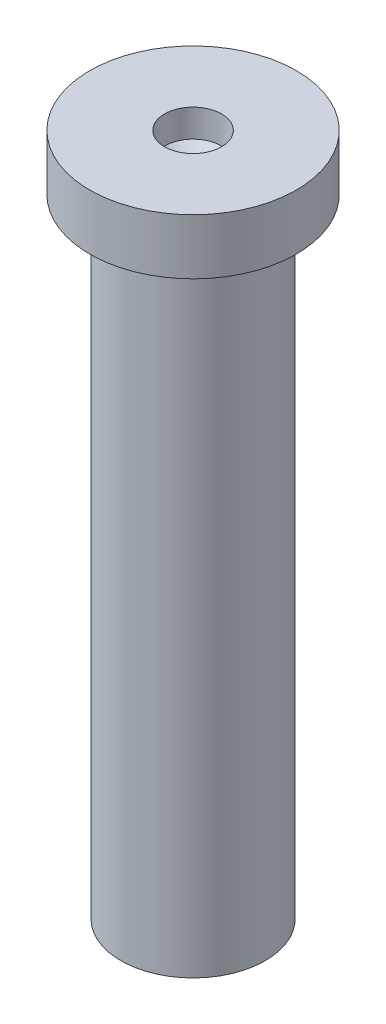
ISO-10303-21;
HEADER;
FILE_DESCRIPTION(('STEP AP214'),'2;1');
FILE_NAME('part.step','',(''),(''),'','','');
FILE_SCHEMA(('AUTOMOTIVE_DESIGN { 1 0 10303 214 1 1 1 1 }'));
ENDSEC;
DATA;
#1=APPLICATION_CONTEXT('core data for automotive mechanical design processes');
#2=APPLICATION_PROTOCOL_DEFINITION('international standard','automotive_design',2000,#1);
#3=PRODUCT_CONTEXT('',#1,'mechanical');
#4=PRODUCT('Part','Part','',(#3));
#5=PRODUCT_RELATED_PRODUCT_CATEGORY('part','',(#4));
#6=PRODUCT_DEFINITION_FORMATION('','',#4);
#7=PRODUCT_DEFINITION_CONTEXT('part definition',#1,'design');
#8=PRODUCT_DEFINITION('design','',#6,#7);
#9=PRODUCT_DEFINITION_SHAPE('','',#8);
#10=(LENGTH_UNIT() NAMED_UNIT(*) SI_UNIT(.MILLI.,.METRE.));
#11=(NAMED_UNIT(*) PLANE_ANGLE_UNIT() SI_UNIT($,.RADIAN.));
#12=(NAMED_UNIT(*) SI_UNIT($,.STERADIAN.) SOLID_ANGLE_UNIT());
#13=UNCERTAINTY_MEASURE_WITH_UNIT(LENGTH_MEASURE(1.E-05),#10,'distance_accuracy_value','');
#14=(GEOMETRIC_REPRESENTATION_CONTEXT(3) GLOBAL_UNCERTAINTY_ASSIGNED_CONTEXT((#13)) GLOBAL_UNIT_ASSIGNED_CONTEXT((#10,
#11,#12)) REPRESENTATION_CONTEXT('',''));
#15=CARTESIAN_POINT('',(0.,0.,0.));
#16=DIRECTION('',(0.,0.,1.));
#17=DIRECTION('',(1.,0.,0.));
#18=AXIS2_PLACEMENT_3D('',#15,#16,#17);
#19=CARTESIAN_POINT('',(0.,0.,0.));
#20=DIRECTION('',(0.,-1.,0.));
#21=DIRECTION('',(0.,0.,-1.));
#22=AXIS2_PLACEMENT_3D('',#19,#20,#21);
#23=PLANE('',#22);
#24=CARTESIAN_POINT('',(0.,0.,0.));
#25=DIRECTION('',(0.,-1.,0.));
#26=DIRECTION('',(0.,0.,-1.));
#27=AXIS2_PLACEMENT_3D('',#24,#25,#26);
#28=CIRCLE('',#27,1.3);
#29=CARTESIAN_POINT('',(0.,0.,-1.3));
#30=VERTEX_POINT('',#29);
#31=EDGE_CURVE('E11',#30,#30,#28,.T.);
#32=ORIENTED_EDGE('',*,*,#31,.T.);
#33=EDGE_LOOP('',(#32));
#34=FACE_BOUND('',#33,.T.);
#35=ADVANCED_FACE('F41',(#34),#23,.T.);
#36=CARTESIAN_POINT('',(0.,0.,0.));
#37=DIRECTION('',(0.,-1.,0.));
#38=DIRECTION('',(0.,0.,-1.));
#39=AXIS2_PLACEMENT_3D('',#36,#37,#38);
#40=CYLINDRICAL_SURFACE('',#39,1.3);
#41=CARTESIAN_POINT('',(0.,11.3,0.));
#42=DIRECTION('',(0.,-1.,0.));
#43=DIRECTION('',(0.,0.,-1.));
#44=AXIS2_PLACEMENT_3D('',#41,#42,#43);
#45=CIRCLE('',#44,1.3);
#46=CARTESIAN_POINT('',(0.,11.3,-1.3));
#47=VERTEX_POINT('',#46);
#48=EDGE_CURVE('E48',#47,#47,#45,.T.);
#49=ORIENTED_EDGE('',*,*,#48,.T.);
#50=EDGE_LOOP('',(#49));
#51=FACE_BOUND('',#50,.T.);
#52=ORIENTED_EDGE('',*,*,#31,.F.);
#53=EDGE_LOOP('',(#52));
#54=FACE_BOUND('',#53,.T.);
#55=ADVANCED_FACE('F78',(#51,#54),#40,.T.);
#56=CARTESIAN_POINT('',(1.3,11.3,0.));
#57=DIRECTION('',(0.,-1.,0.));
#58=DIRECTION('',(0.,0.,-1.));
#59=AXIS2_PLACEMENT_3D('',#56,#57,#58);
#60=PLANE('',#59);
#61=CARTESIAN_POINT('',(0.,11.3,0.));
#62=DIRECTION('',(0.,-1.,0.));
#63=DIRECTION('',(0.,0.,-1.));
#64=AXIS2_PLACEMENT_3D('',#61,#62,#63);
#65=CIRCLE('',#64,1.86144790437702);
#66=CARTESIAN_POINT('',(0.,11.3,-1.86144790437702));
#67=VERTEX_POINT('',#66);
#68=EDGE_CURVE('E71',#67,#67,#65,.T.);
#69=ORIENTED_EDGE('',*,*,#68,.T.);
#70=EDGE_LOOP('',(#69));
#71=FACE_BOUND('',#70,.T.);
#72=ORIENTED_EDGE('',*,*,#48,.F.);
#73=EDGE_LOOP('',(#72));
#74=FACE_BOUND('',#73,.T.);
#75=ADVANCED_FACE('F81',(#71,#74),#60,.T.);
#76=CARTESIAN_POINT('',(0.,0.,0.));
#77=DIRECTION('',(0.,-1.,0.));
#78=DIRECTION('',(0.,0.,-1.));
#79=AXIS2_PLACEMENT_3D('',#76,#77,#78);
#80=CYLINDRICAL_SURFACE('',#79,1.86144790437702);
#81=CARTESIAN_POINT('',(0.,12.3,0.));
#82=DIRECTION('',(0.,-1.,0.));
#83=DIRECTION('',(0.,0.,-1.));
#84=AXIS2_PLACEMENT_3D('',#81,#82,#83);
#85=CIRCLE('',#84,1.86144790437702);
#86=CARTESIAN_POINT('',(0.,12.3,-1.86144790437702));
#87=VERTEX_POINT('',#86);
#88=EDGE_CURVE('E65',#87,#87,#85,.T.);
#89=ORIENTED_EDGE('',*,*,#88,.T.);
#90=EDGE_LOOP('',(#89));
#91=FACE_BOUND('',#90,.T.);
#92=ORIENTED_EDGE('',*,*,#68,.F.);
#93=EDGE_LOOP('',(#92));
#94=FACE_BOUND('',#93,.T.);
#95=ADVANCED_FACE('F83',(#91,#94),#80,.T.);
#96=CARTESIAN_POINT('',(1.86144790437702,12.3,0.));
#97=DIRECTION('',(0.,1.,0.));
#98=DIRECTION('',(0.,0.,1.));
#99=AXIS2_PLACEMENT_3D('',#96,#97,#98);
#100=PLANE('',#99);
#101=CARTESIAN_POINT('',(0.,12.3,0.));
#102=DIRECTION('',(0.,-1.,0.));
#103=DIRECTION('',(0.,0.,-1.));
#104=AXIS2_PLACEMENT_3D('',#101,#102,#103);
#105=CIRCLE('',#104,0.51316806995542);
#106=CARTESIAN_POINT('',(0.,12.3,-0.51316806995542));
#107=VERTEX_POINT('',#106);
#108=EDGE_CURVE('E61',#107,#107,#105,.T.);
#109=ORIENTED_EDGE('',*,*,#108,.T.);
#110=EDGE_LOOP('',(#109));
#111=FACE_BOUND('',#110,.T.);
#112=ORIENTED_EDGE('',*,*,#88,.F.);
#113=EDGE_LOOP('',(#112));
#114=FACE_BOUND('',#113,.T.);
#115=ADVANCED_FACE('F90',(#111,#114),#100,.T.);
#116=CARTESIAN_POINT('',(0.,0.,0.));
#117=DIRECTION('',(0.,-1.,0.));
#118=DIRECTION('',(0.,0.,-1.));
#119=AXIS2_PLACEMENT_3D('',#116,#117,#118);
#120=CYLINDRICAL_SURFACE('',#119,0.51316806995542);
#121=CARTESIAN_POINT('',(0.,11.8,0.));
#122=DIRECTION('',(0.,-1.,0.));
#123=DIRECTION('',(0.,0.,-1.));
#124=AXIS2_PLACEMENT_3D('',#121,#122,#123);
#125=CIRCLE('',#124,0.51316806995542);
#126=CARTESIAN_POINT('',(0.,11.8,-0.51316806995542));
#127=VERTEX_POINT('',#126);
#128=EDGE_CURVE('E58',#127,#127,#125,.T.);
#129=ORIENTED_EDGE('',*,*,#128,.T.);
#130=EDGE_LOOP('',(#129));
#131=FACE_BOUND('',#130,.T.);
#132=ORIENTED_EDGE('',*,*,#108,.F.);
#133=EDGE_LOOP('',(#132));
#134=FACE_BOUND('',#133,.T.);
#135=ADVANCED_FACE('F54',(#131,#134),#120,.F.);
#136=CARTESIAN_POINT('',(0.,11.8,0.));
#137=DIRECTION('',(0.,1.,0.));
#138=DIRECTION('',(0.,0.,1.));
#139=AXIS2_PLACEMENT_3D('',#136,#137,#138);
#140=CONICAL_SURFACE('',#139,0.51316806995542,0.959316799184363);
#141=CARTESIAN_POINT('',(0.,11.4402058569948,0.));
#142=VERTEX_POINT('',#141);
#143=VERTEX_LOOP('',#142);
#144=FACE_BOUND('',#143,.T.);
#145=ORIENTED_EDGE('',*,*,#128,.F.);
#146=EDGE_LOOP('',(#145));
#147=FACE_BOUND('',#146,.T.);
#148=ADVANCED_FACE('F51',(#144,#147),#140,.F.);
#149=CLOSED_SHELL('',(#35,#55,#75,#95,#115,#135,#148));
#150=MANIFOLD_SOLID_BREP('B2',#149);
#151=ADVANCED_BREP_SHAPE_REPRESENTATION('',(#18,#150),#14);
#152=SHAPE_DEFINITION_REPRESENTATION(#9,#151);
ENDSEC;
END-ISO-10303-21;
